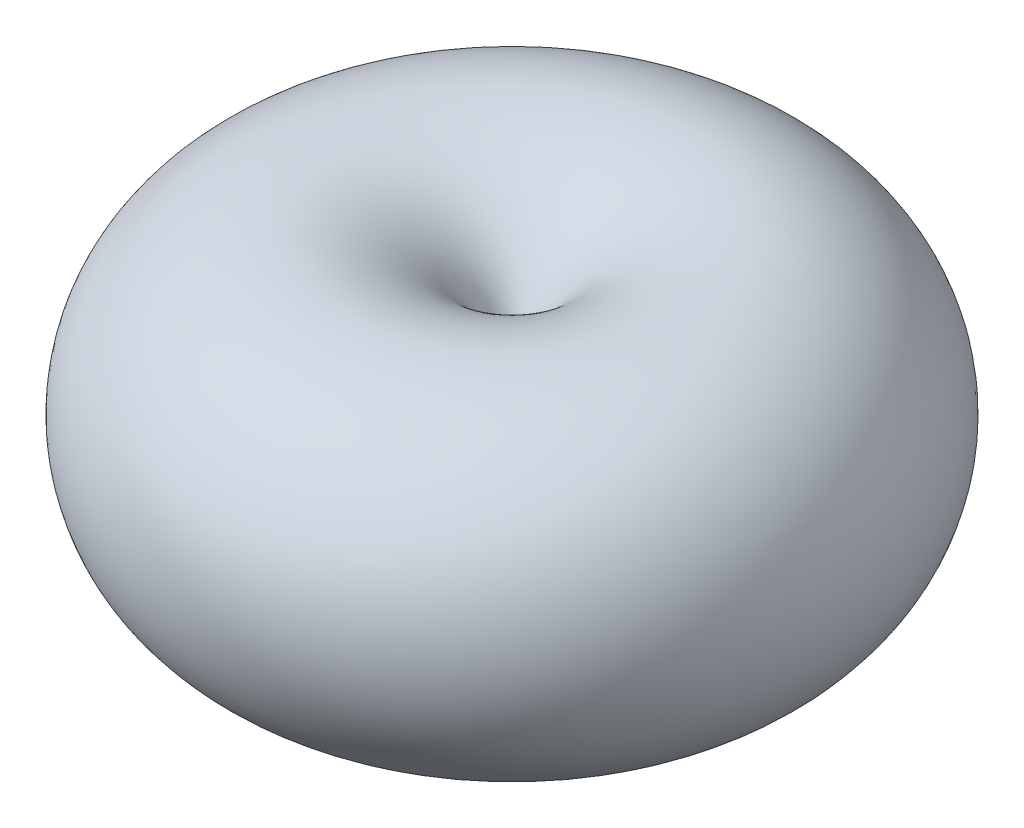
ISO-10303-21;
HEADER;
FILE_DESCRIPTION(('STEP AP214'),'2;1');
FILE_NAME('part.step','',(''),(''),'','','');
FILE_SCHEMA(('AUTOMOTIVE_DESIGN { 1 0 10303 214 1 1 1 1 }'));
ENDSEC;
DATA;
#1=APPLICATION_CONTEXT('core data for automotive mechanical design processes');
#2=APPLICATION_PROTOCOL_DEFINITION('international standard','automotive_design',2000,#1);
#3=PRODUCT_CONTEXT('',#1,'mechanical');
#4=PRODUCT('Part','Part','',(#3));
#5=PRODUCT_RELATED_PRODUCT_CATEGORY('part','',(#4));
#6=PRODUCT_DEFINITION_FORMATION('','',#4);
#7=PRODUCT_DEFINITION_CONTEXT('part definition',#1,'design');
#8=PRODUCT_DEFINITION('design','',#6,#7);
#9=PRODUCT_DEFINITION_SHAPE('','',#8);
#10=(LENGTH_UNIT() NAMED_UNIT(*) SI_UNIT(.MILLI.,.METRE.));
#11=(NAMED_UNIT(*) PLANE_ANGLE_UNIT() SI_UNIT($,.RADIAN.));
#12=(NAMED_UNIT(*) SI_UNIT($,.STERADIAN.) SOLID_ANGLE_UNIT());
#13=UNCERTAINTY_MEASURE_WITH_UNIT(LENGTH_MEASURE(1.E-05),#10,'distance_accuracy_value','');
#14=(GEOMETRIC_REPRESENTATION_CONTEXT(3) GLOBAL_UNCERTAINTY_ASSIGNED_CONTEXT((#13)) GLOBAL_UNIT_ASSIGNED_CONTEXT((#10,
#11,#12)) REPRESENTATION_CONTEXT('',''));
#15=CARTESIAN_POINT('',(0.,0.,0.));
#16=DIRECTION('',(0.,0.,1.));
#17=DIRECTION('',(1.,0.,0.));
#18=AXIS2_PLACEMENT_3D('',#15,#16,#17);
#19=CARTESIAN_POINT('',(0.,-0.770597773904212,9.25553886636906));
#20=DIRECTION('',(-1.,0.,0.));
#21=DIRECTION('',(0.,0.,1.));
#22=AXIS2_PLACEMENT_3D('',#19,#20,#21);
#23=CIRCLE('',#22,9.28756268544199);
#24=TRIMMED_CURVE('',#23,(PARAMETER_VALUE(-3.05852622319552)),
(PARAMETER_VALUE(3.05852622319552)),.T.,.PARAMETER.);
#25=CARTESIAN_POINT('',(0.,-0.770597773904212,0.));
#26=DIRECTION('',(0.,1.,0.));
#27=AXIS1_PLACEMENT('',#25,#26);
#28=SURFACE_OF_REVOLUTION('',#24,#27);
#29=CARTESIAN_POINT('',(0.,0.,0.));
#30=VERTEX_POINT('',#29);
#31=VERTEX_LOOP('',#30);
#32=FACE_BOUND('',#31,.T.);
#33=CARTESIAN_POINT('',(0.,-1.54119554780839,0.));
#34=VERTEX_POINT('',#33);
#35=VERTEX_LOOP('',#34);
#36=FACE_BOUND('',#35,.T.);
#37=ADVANCED_FACE('F31',(#32,#36),#28,.T.);
#38=CLOSED_SHELL('',(#37));
#39=MANIFOLD_SOLID_BREP('B2',#38);
#40=ADVANCED_BREP_SHAPE_REPRESENTATION('',(#18,#39),#14);
#41=SHAPE_DEFINITION_REPRESENTATION(#9,#40);
ENDSEC;
END-ISO-10303-21;
